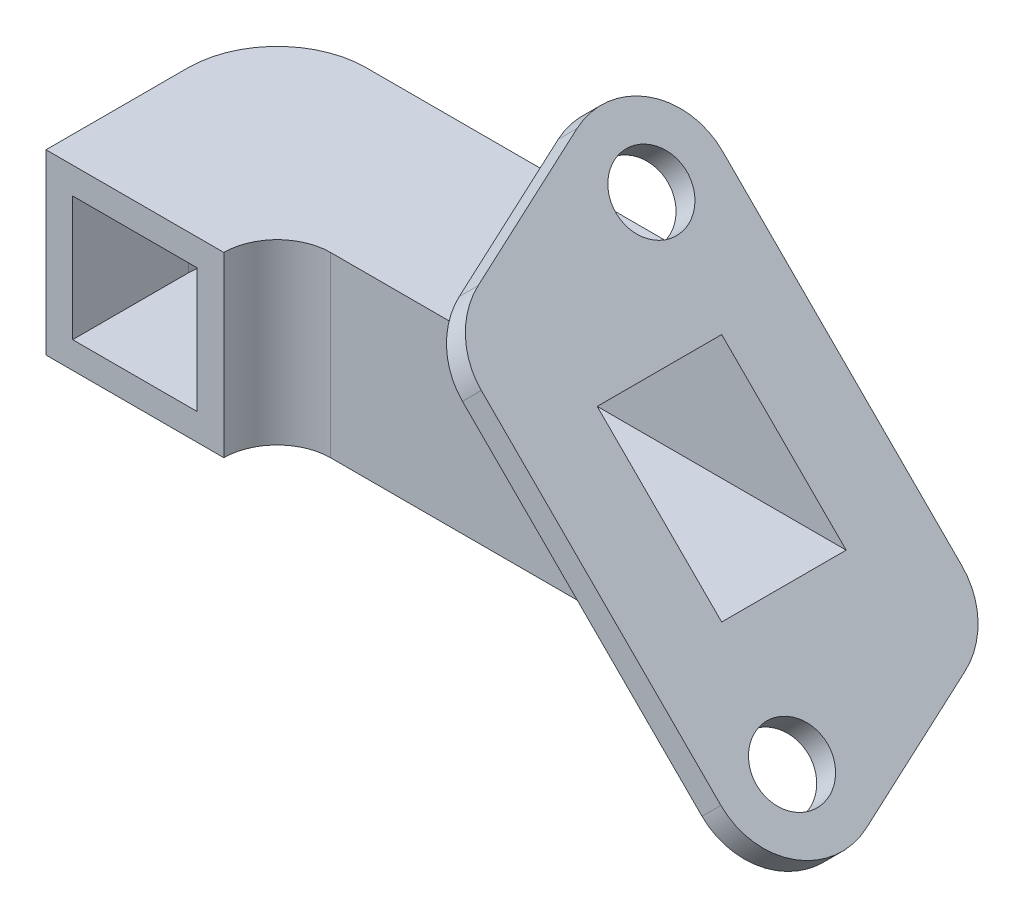
ISO-10303-21;
HEADER;
FILE_DESCRIPTION(('STEP AP214'),'2;1');
FILE_NAME('part.step','',(''),(''),'','','');
FILE_SCHEMA(('AUTOMOTIVE_DESIGN { 1 0 10303 214 1 1 1 1 }'));
ENDSEC;
DATA;
#1=APPLICATION_CONTEXT('core data for automotive mechanical design processes');
#2=APPLICATION_PROTOCOL_DEFINITION('international standard','automotive_design',2000,#1);
#3=PRODUCT_CONTEXT('',#1,'mechanical');
#4=PRODUCT('Part','Part','',(#3));
#5=PRODUCT_RELATED_PRODUCT_CATEGORY('part','',(#4));
#6=PRODUCT_DEFINITION_FORMATION('','',#4);
#7=PRODUCT_DEFINITION_CONTEXT('part definition',#1,'design');
#8=PRODUCT_DEFINITION('design','',#6,#7);
#9=PRODUCT_DEFINITION_SHAPE('','',#8);
#10=(LENGTH_UNIT() NAMED_UNIT(*) SI_UNIT(.MILLI.,.METRE.));
#11=(NAMED_UNIT(*) PLANE_ANGLE_UNIT() SI_UNIT($,.RADIAN.));
#12=(NAMED_UNIT(*) SI_UNIT($,.STERADIAN.) SOLID_ANGLE_UNIT());
#13=UNCERTAINTY_MEASURE_WITH_UNIT(LENGTH_MEASURE(1.E-05),#10,'distance_accuracy_value','');
#14=(GEOMETRIC_REPRESENTATION_CONTEXT(3) GLOBAL_UNCERTAINTY_ASSIGNED_CONTEXT((#13)) GLOBAL_UNIT_ASSIGNED_CONTEXT((#10,
#11,#12)) REPRESENTATION_CONTEXT('',''));
#15=CARTESIAN_POINT('',(0.,0.,0.));
#16=DIRECTION('',(0.,0.,1.));
#17=DIRECTION('',(1.,0.,0.));
#18=AXIS2_PLACEMENT_3D('',#15,#16,#17);
#19=CARTESIAN_POINT('',(22.071125761932,-22.0711257619321,-16.));
#20=DIRECTION('',(0.707106781186549,0.707106781186546,0.));
#21=DIRECTION('',(-0.707106781186546,0.707106781186549,0.));
#22=AXIS2_PLACEMENT_3D('',#19,#20,#21);
#23=PLANE('',#22);
#24=CARTESIAN_POINT('',(31.8198051533946,-31.8198051533947,16.));
#25=DIRECTION('',(0.707106781186549,0.707106781186546,0.));
#26=DIRECTION('',(-0.707106781186546,0.707106781186549,0.));
#27=AXIS2_PLACEMENT_3D('',#24,#25,#26);
#28=CIRCLE('',#27,8.);
#29=CARTESIAN_POINT('',(26.1629509039022,-26.1629509039023,16.));
#30=VERTEX_POINT('',#29);
#31=EDGE_CURVE('E260',#30,#30,#28,.T.);
#32=ORIENTED_EDGE('',*,*,#31,.F.);
#33=EDGE_LOOP('',(#32));
#34=FACE_BOUND('',#33,.T.);
#35=CARTESIAN_POINT('',(-31.8198051533946,31.8198051533947,-16.));
#36=DIRECTION('',(0.707106781186549,0.707106781186546,0.));
#37=DIRECTION('',(-0.707106781186546,0.707106781186549,0.));
#38=AXIS2_PLACEMENT_3D('',#35,#36,#37);
#39=CIRCLE('',#38,8.);
#40=CARTESIAN_POINT('',(-37.476659402887,37.4766594028871,-16.));
#41=VERTEX_POINT('',#40);
#42=EDGE_CURVE('E272',#41,#41,#39,.T.);
#43=ORIENTED_EDGE('',*,*,#42,.F.);
#44=EDGE_LOOP('',(#43));
#45=FACE_BOUND('',#44,.T.);
#46=CARTESIAN_POINT('',(22.071125761932,-22.0711257619321,-16.));
#47=DIRECTION('',(0.707106781186549,0.707106781186546,0.));
#48=DIRECTION('',(-0.707106781186546,0.707106781186549,0.));
#49=AXIS2_PLACEMENT_3D('',#46,#47,#48);
#50=CIRCLE('',#49,16.);
#51=CARTESIAN_POINT('',(32.4615306995758,-32.4615306995759,-22.3307954052849));
#52=VERTEX_POINT('',#51);
#53=CARTESIAN_POINT('',(22.071125761932,-22.0711257619321,-32.));
#54=VERTEX_POINT('',#53);
#55=EDGE_CURVE('E277',#52,#54,#50,.T.);
#56=ORIENTED_EDGE('',*,*,#55,.T.);
#57=DIRECTION('',(-0.707106781186546,0.707106781186549,0.));
#58=VECTOR('',#57,1.);
#59=CARTESIAN_POINT('',(-31.8198051533946,31.8198051533947,-32.));
#60=LINE('',#59,#58);
#61=CARTESIAN_POINT('',(-31.8198051533946,31.8198051533947,-32.));
#62=VERTEX_POINT('',#61);
#63=EDGE_CURVE('E308',#54,#62,#60,.T.);
#64=ORIENTED_EDGE('',*,*,#63,.T.);
#65=CARTESIAN_POINT('',(-31.8198051533946,31.8198051533947,-16.));
#66=DIRECTION('',(0.707106781186549,0.707106781186546,0.));
#67=DIRECTION('',(0.707106781186546,-0.707106781186549,0.));
#68=AXIS2_PLACEMENT_3D('',#65,#66,#67);
#69=CIRCLE('',#68,16.);
#70=CARTESIAN_POINT('',(-42.2102100910383,42.2102100910385,-9.66920459471507));
#71=VERTEX_POINT('',#70);
#72=EDGE_CURVE('E311',#62,#71,#69,.T.);
#73=ORIENTED_EDGE('',*,*,#72,.T.);
#74=DIRECTION('',(0.27978427258635,-0.279784272586351,0.918390723835261));
#75=VECTOR('',#74,1.);
#76=CARTESIAN_POINT('',(-32.4615306995758,32.4615306995759,22.3307954052849));
#77=LINE('',#76,#75);
#78=CARTESIAN_POINT('',(-32.4615306995758,32.4615306995759,22.3307954052849));
#79=VERTEX_POINT('',#78);
#80=EDGE_CURVE('E314',#71,#79,#77,.T.);
#81=ORIENTED_EDGE('',*,*,#80,.T.);
#82=CARTESIAN_POINT('',(-22.071125761932,22.0711257619321,16.));
#83=DIRECTION('',(0.707106781186549,0.707106781186546,0.));
#84=DIRECTION('',(0.707106781186546,-0.707106781186549,0.));
#85=AXIS2_PLACEMENT_3D('',#82,#83,#84);
#86=CIRCLE('',#85,16.);
#87=CARTESIAN_POINT('',(-22.071125761932,22.0711257619321,32.));
#88=VERTEX_POINT('',#87);
#89=EDGE_CURVE('E317',#79,#88,#86,.T.);
#90=ORIENTED_EDGE('',*,*,#89,.T.);
#91=DIRECTION('',(0.707106781186546,-0.707106781186549,0.));
#92=VECTOR('',#91,1.);
#93=CARTESIAN_POINT('',(31.8198051533946,-31.8198051533947,32.));
#94=LINE('',#93,#92);
#95=CARTESIAN_POINT('',(31.8198051533946,-31.8198051533947,32.));
#96=VERTEX_POINT('',#95);
#97=EDGE_CURVE('E320',#88,#96,#94,.T.);
#98=ORIENTED_EDGE('',*,*,#97,.T.);
#99=CARTESIAN_POINT('',(31.8198051533946,-31.8198051533947,16.));
#100=DIRECTION('',(0.707106781186549,0.707106781186546,0.));
#101=DIRECTION('',(0.707106781186546,-0.707106781186549,0.));
#102=AXIS2_PLACEMENT_3D('',#99,#100,#101);
#103=CIRCLE('',#102,16.);
#104=CARTESIAN_POINT('',(42.2102100910383,-42.2102100910385,9.66920459471509));
#105=VERTEX_POINT('',#104);
#106=EDGE_CURVE('E323',#96,#105,#103,.T.);
#107=ORIENTED_EDGE('',*,*,#106,.T.);
#108=DIRECTION('',(-0.279784272586349,0.27978427258635,-0.918390723835261));
#109=VECTOR('',#108,1.);
#110=CARTESIAN_POINT('',(32.4615306995758,-32.4615306995759,-22.3307954052849));
#111=LINE('',#110,#109);
#112=EDGE_CURVE('E284',#105,#52,#111,.T.);
#113=ORIENTED_EDGE('',*,*,#112,.T.);
#114=EDGE_LOOP('',(#56,#64,#73,#81,#90,#98,#107,#113));
#115=FACE_BOUND('',#114,.T.);
#116=DIRECTION('',(-0.707106781186546,0.707106781186549,0.));
#117=VECTOR('',#116,1.);
#118=CARTESIAN_POINT('',(22.071125761932,-22.0711257619321,-14.));
#119=LINE('',#118,#117);
#120=CARTESIAN_POINT('',(14.,-14.,-14.));
#121=VERTEX_POINT('',#120);
#122=CARTESIAN_POINT('',(-14.,14.,-14.));
#123=VERTEX_POINT('',#122);
#124=EDGE_CURVE('E218',#121,#123,#119,.T.);
#125=ORIENTED_EDGE('',*,*,#124,.F.);
#126=DIRECTION('',(0.,0.,1.));
#127=VECTOR('',#126,1.);
#128=CARTESIAN_POINT('',(14.,-14.,-16.));
#129=LINE('',#128,#127);
#130=CARTESIAN_POINT('',(14.,-14.,14.));
#131=VERTEX_POINT('',#130);
#132=EDGE_CURVE('E449',#121,#131,#129,.T.);
#133=ORIENTED_EDGE('',*,*,#132,.T.);
#134=DIRECTION('',(0.707106781186546,-0.707106781186549,0.));
#135=VECTOR('',#134,1.);
#136=CARTESIAN_POINT('',(22.071125761932,-22.0711257619321,14.));
#137=LINE('',#136,#135);
#138=CARTESIAN_POINT('',(-14.,14.,14.));
#139=VERTEX_POINT('',#138);
#140=EDGE_CURVE('E212',#139,#131,#137,.T.);
#141=ORIENTED_EDGE('',*,*,#140,.F.);
#142=DIRECTION('',(0.,0.,1.));
#143=VECTOR('',#142,1.);
#144=CARTESIAN_POINT('',(-14.,14.,-16.));
#145=LINE('',#144,#143);
#146=EDGE_CURVE('E451',#123,#139,#145,.T.);
#147=ORIENTED_EDGE('',*,*,#146,.F.);
#148=EDGE_LOOP('',(#125,#133,#141,#147));
#149=FACE_BOUND('',#148,.T.);
#150=ADVANCED_FACE('F33',(#34,#45,#115,#149),#23,.T.);
#151=CARTESIAN_POINT('',(0.,0.,32.));
#152=DIRECTION('',(0.,0.,1.));
#153=DIRECTION('',(1.,0.,0.));
#154=AXIS2_PLACEMENT_3D('',#151,#152,#153);
#155=PLANE('',#154);
#156=DIRECTION('',(0.,-1.,0.));
#157=VECTOR('',#156,1.);
#158=CARTESIAN_POINT('',(-120.,20.,32.));
#159=LINE('',#158,#157);
#160=CARTESIAN_POINT('',(-120.,20.,32.));
#161=VERTEX_POINT('',#160);
#162=CARTESIAN_POINT('',(-120.,-20.,32.));
#163=VERTEX_POINT('',#162);
#164=EDGE_CURVE('E471',#161,#163,#159,.T.);
#165=ORIENTED_EDGE('',*,*,#164,.T.);
#166=DIRECTION('',(1.,0.,0.));
#167=VECTOR('',#166,1.);
#168=CARTESIAN_POINT('',(-120.,-20.,32.));
#169=LINE('',#168,#167);
#170=CARTESIAN_POINT('',(-80.,-20.,32.));
#171=VERTEX_POINT('',#170);
#172=EDGE_CURVE('E258',#163,#171,#169,.T.);
#173=ORIENTED_EDGE('',*,*,#172,.T.);
#174=DIRECTION('',(0.,1.,0.));
#175=VECTOR('',#174,1.);
#176=CARTESIAN_POINT('',(-80.,20.,32.));
#177=LINE('',#176,#175);
#178=CARTESIAN_POINT('',(-80.,20.,32.));
#179=VERTEX_POINT('',#178);
#180=EDGE_CURVE('E474',#171,#179,#177,.T.);
#181=ORIENTED_EDGE('',*,*,#180,.T.);
#182=DIRECTION('',(-1.,0.,0.));
#183=VECTOR('',#182,1.);
#184=CARTESIAN_POINT('',(-120.,20.,32.));
#185=LINE('',#184,#183);
#186=EDGE_CURVE('E477',#179,#161,#185,.T.);
#187=ORIENTED_EDGE('',*,*,#186,.T.);
#188=EDGE_LOOP('',(#165,#173,#181,#187));
#189=FACE_BOUND('',#188,.T.);
#190=DIRECTION('',(0.,1.,0.));
#191=VECTOR('',#190,1.);
#192=CARTESIAN_POINT('',(-86.,0.,32.));
#193=LINE('',#192,#191);
#194=CARTESIAN_POINT('',(-86.,-14.,32.));
#195=VERTEX_POINT('',#194);
#196=CARTESIAN_POINT('',(-86.,14.,32.));
#197=VERTEX_POINT('',#196);
#198=EDGE_CURVE('E206',#195,#197,#193,.T.);
#199=ORIENTED_EDGE('',*,*,#198,.F.);
#200=DIRECTION('',(-1.,0.,0.));
#201=VECTOR('',#200,1.);
#202=CARTESIAN_POINT('',(0.,-14.,32.));
#203=LINE('',#202,#201);
#204=CARTESIAN_POINT('',(-114.,-14.,32.));
#205=VERTEX_POINT('',#204);
#206=EDGE_CURVE('E210',#195,#205,#203,.T.);
#207=ORIENTED_EDGE('',*,*,#206,.T.);
#208=DIRECTION('',(0.,-1.,0.));
#209=VECTOR('',#208,1.);
#210=CARTESIAN_POINT('',(-114.,0.,32.));
#211=LINE('',#210,#209);
#212=CARTESIAN_POINT('',(-114.,14.,32.));
#213=VERTEX_POINT('',#212);
#214=EDGE_CURVE('E192',#213,#205,#211,.T.);
#215=ORIENTED_EDGE('',*,*,#214,.F.);
#216=DIRECTION('',(-1.,0.,0.));
#217=VECTOR('',#216,1.);
#218=CARTESIAN_POINT('',(0.,14.,32.));
#219=LINE('',#218,#217);
#220=EDGE_CURVE('E200',#197,#213,#219,.T.);
#221=ORIENTED_EDGE('',*,*,#220,.F.);
#222=EDGE_LOOP('',(#199,#207,#215,#221));
#223=FACE_BOUND('',#222,.T.);
#224=ADVANCED_FACE('F209',(#189,#223),#155,.T.);
#225=CARTESIAN_POINT('',(0.,0.,20.));
#226=DIRECTION('',(0.,0.,1.));
#227=DIRECTION('',(1.,0.,0.));
#228=AXIS2_PLACEMENT_3D('',#225,#226,#227);
#229=PLANE('',#228);
#230=DIRECTION('',(1.,0.,0.));
#231=VECTOR('',#230,1.);
#232=CARTESIAN_POINT('',(-120.,20.,20.));
#233=LINE('',#232,#231);
#234=CARTESIAN_POINT('',(-68.,20.,20.));
#235=VERTEX_POINT('',#234);
#236=CARTESIAN_POINT('',(-28.4852813742385,20.,20.));
#237=VERTEX_POINT('',#236);
#238=EDGE_CURVE('E487',#235,#237,#233,.T.);
#239=ORIENTED_EDGE('',*,*,#238,.F.);
#240=DIRECTION('',(0.,1.,0.));
#241=VECTOR('',#240,1.);
#242=CARTESIAN_POINT('',(-68.,0.,20.));
#243=LINE('',#242,#241);
#244=CARTESIAN_POINT('',(-68.,-20.,20.));
#245=VERTEX_POINT('',#244);
#246=EDGE_CURVE('E221',#235,#245,#243,.F.);
#247=ORIENTED_EDGE('',*,*,#246,.T.);
#248=DIRECTION('',(1.,0.,0.));
#249=VECTOR('',#248,1.);
#250=CARTESIAN_POINT('',(-120.,-20.,20.));
#251=LINE('',#250,#249);
#252=CARTESIAN_POINT('',(11.5147186257614,-20.,20.));
#253=VERTEX_POINT('',#252);
#254=EDGE_CURVE('E481',#245,#253,#251,.T.);
#255=ORIENTED_EDGE('',*,*,#254,.T.);
#256=DIRECTION('',(0.707106781186546,-0.707106781186549,0.));
#257=VECTOR('',#256,1.);
#258=CARTESIAN_POINT('',(-28.4852813742385,20.,20.));
#259=LINE('',#258,#257);
#260=EDGE_CURVE('E483',#237,#253,#259,.T.);
#261=ORIENTED_EDGE('',*,*,#260,.F.);
#262=EDGE_LOOP('',(#239,#247,#255,#261));
#263=FACE_BOUND('',#262,.T.);
#264=ADVANCED_FACE('F391',(#263),#229,.T.);
#265=CARTESIAN_POINT('',(17.8284850748127,-26.3137664490514,-16.));
#266=DIRECTION('',(0.707106781186549,0.707106781186546,0.));
#267=DIRECTION('',(-0.707106781186546,0.707106781186549,0.));
#268=AXIS2_PLACEMENT_3D('',#265,#266,#267);
#269=CYLINDRICAL_SURFACE('',#268,16.);
#270=ORIENTED_EDGE('',*,*,#55,.F.);
#271=DIRECTION('',(0.707106781186549,0.707106781186546,0.));
#272=VECTOR('',#271,1.);
#273=CARTESIAN_POINT('',(28.2188900124565,-36.7041713866952,-22.3307954052849));
#274=LINE('',#273,#272);
#275=CARTESIAN_POINT('',(28.2188900124565,-36.7041713866952,-22.3307954052849));
#276=VERTEX_POINT('',#275);
#277=EDGE_CURVE('E207',#276,#52,#274,.T.);
#278=ORIENTED_EDGE('',*,*,#277,.F.);
#279=CARTESIAN_POINT('',(17.8284850748127,-26.3137664490514,-16.));
#280=DIRECTION('',(0.707106781186549,0.707106781186546,0.));
#281=DIRECTION('',(-0.707106781186546,0.707106781186549,0.));
#282=AXIS2_PLACEMENT_3D('',#279,#280,#281);
#283=CIRCLE('',#282,16.);
#284=CARTESIAN_POINT('',(17.8284850748127,-26.3137664490514,-32.));
#285=VERTEX_POINT('',#284);
#286=EDGE_CURVE('E280',#276,#285,#283,.T.);
#287=ORIENTED_EDGE('',*,*,#286,.T.);
#288=DIRECTION('',(0.707106781186549,0.707106781186546,0.));
#289=VECTOR('',#288,1.);
#290=CARTESIAN_POINT('',(17.8284850748127,-26.3137664490514,-32.));
#291=LINE('',#290,#289);
#292=EDGE_CURVE('E305',#285,#54,#291,.T.);
#293=ORIENTED_EDGE('',*,*,#292,.T.);
#294=EDGE_LOOP('',(#270,#278,#287,#293));
#295=FACE_BOUND('',#294,.T.);
#296=ADVANCED_FACE('F344',(#295),#269,.T.);
#297=CARTESIAN_POINT('',(28.2188900124565,-36.7041713866952,-22.3307954052849));
#298=DIRECTION('',(0.649400308602734,-0.649400308602736,-0.395674712830307));
#299=DIRECTION('',(0.707106781186549,0.707106781186546,0.));
#300=AXIS2_PLACEMENT_3D('',#297,#298,#299);
#301=PLANE('',#300);
#302=ORIENTED_EDGE('',*,*,#112,.F.);
#303=DIRECTION('',(0.707106781186549,0.707106781186546,0.));
#304=VECTOR('',#303,1.);
#305=CARTESIAN_POINT('',(37.967569403919,-46.4528507781577,9.66920459471509));
#306=LINE('',#305,#304);
#307=CARTESIAN_POINT('',(37.967569403919,-46.4528507781577,9.66920459471509));
#308=VERTEX_POINT('',#307);
#309=EDGE_CURVE('E329',#308,#105,#306,.T.);
#310=ORIENTED_EDGE('',*,*,#309,.F.);
#311=DIRECTION('',(-0.279784272586349,0.27978427258635,-0.918390723835261));
#312=VECTOR('',#311,1.);
#313=CARTESIAN_POINT('',(28.2188900124565,-36.7041713866952,-22.3307954052849));
#314=LINE('',#313,#312);
#315=EDGE_CURVE('E302',#308,#276,#314,.T.);
#316=ORIENTED_EDGE('',*,*,#315,.T.);
#317=ORIENTED_EDGE('',*,*,#277,.T.);
#318=EDGE_LOOP('',(#302,#310,#316,#317));
#319=FACE_BOUND('',#318,.T.);
#320=ADVANCED_FACE('F355',(#319),#301,.T.);
#321=CARTESIAN_POINT('',(27.5771644662753,-36.062445840514,16.));
#322=DIRECTION('',(0.707106781186549,0.707106781186546,0.));
#323=DIRECTION('',(-0.707106781186546,0.707106781186549,0.));
#324=AXIS2_PLACEMENT_3D('',#321,#322,#323);
#325=CYLINDRICAL_SURFACE('',#324,16.);
#326=ORIENTED_EDGE('',*,*,#106,.F.);
#327=DIRECTION('',(0.707106781186549,0.707106781186546,0.));
#328=VECTOR('',#327,1.);
#329=CARTESIAN_POINT('',(27.5771644662753,-36.062445840514,32.));
#330=LINE('',#329,#328);
#331=CARTESIAN_POINT('',(27.5771644662753,-36.062445840514,32.));
#332=VERTEX_POINT('',#331);
#333=EDGE_CURVE('E331',#332,#96,#330,.T.);
#334=ORIENTED_EDGE('',*,*,#333,.F.);
#335=CARTESIAN_POINT('',(27.5771644662753,-36.062445840514,16.));
#336=DIRECTION('',(0.707106781186549,0.707106781186546,0.));
#337=DIRECTION('',(0.707106781186546,-0.707106781186549,0.));
#338=AXIS2_PLACEMENT_3D('',#335,#336,#337);
#339=CIRCLE('',#338,16.);
#340=EDGE_CURVE('E299',#332,#308,#339,.T.);
#341=ORIENTED_EDGE('',*,*,#340,.T.);
#342=ORIENTED_EDGE('',*,*,#309,.T.);
#343=EDGE_LOOP('',(#326,#334,#341,#342));
#344=FACE_BOUND('',#343,.T.);
#345=ADVANCED_FACE('F376',(#344),#325,.T.);
#346=CARTESIAN_POINT('',(27.5771644662753,-36.062445840514,32.));
#347=DIRECTION('',(0.,0.,1.));
#348=DIRECTION('',(1.,0.,0.));
#349=AXIS2_PLACEMENT_3D('',#346,#347,#348);
#350=PLANE('',#349);
#351=ORIENTED_EDGE('',*,*,#97,.F.);
#352=DIRECTION('',(0.707106781186549,0.707106781186546,0.));
#353=VECTOR('',#352,1.);
#354=CARTESIAN_POINT('',(-26.3137664490513,17.8284850748128,32.));
#355=LINE('',#354,#353);
#356=CARTESIAN_POINT('',(-26.3137664490513,17.8284850748128,32.));
#357=VERTEX_POINT('',#356);
#358=EDGE_CURVE('E333',#357,#88,#355,.T.);
#359=ORIENTED_EDGE('',*,*,#358,.F.);
#360=DIRECTION('',(0.707106781186546,-0.707106781186549,0.));
#361=VECTOR('',#360,1.);
#362=CARTESIAN_POINT('',(27.5771644662753,-36.062445840514,32.));
#363=LINE('',#362,#361);
#364=EDGE_CURVE('E296',#357,#332,#363,.T.);
#365=ORIENTED_EDGE('',*,*,#364,.T.);
#366=ORIENTED_EDGE('',*,*,#333,.T.);
#367=EDGE_LOOP('',(#351,#359,#365,#366));
#368=FACE_BOUND('',#367,.T.);
#369=ADVANCED_FACE('F374',(#368),#350,.T.);
#370=CARTESIAN_POINT('',(-26.3137664490513,17.8284850748128,16.));
#371=DIRECTION('',(0.707106781186549,0.707106781186546,0.));
#372=DIRECTION('',(-0.707106781186546,0.707106781186549,0.));
#373=AXIS2_PLACEMENT_3D('',#370,#371,#372);
#374=CYLINDRICAL_SURFACE('',#373,16.);
#375=ORIENTED_EDGE('',*,*,#89,.F.);
#376=DIRECTION('',(0.707106781186549,0.707106781186546,0.));
#377=VECTOR('',#376,1.);
#378=CARTESIAN_POINT('',(-36.704171386695,28.2188900124566,22.3307954052849));
#379=LINE('',#378,#377);
#380=CARTESIAN_POINT('',(-36.704171386695,28.2188900124566,22.3307954052849));
#381=VERTEX_POINT('',#380);
#382=EDGE_CURVE('E335',#381,#79,#379,.T.);
#383=ORIENTED_EDGE('',*,*,#382,.F.);
#384=CARTESIAN_POINT('',(-26.3137664490513,17.8284850748128,16.));
#385=DIRECTION('',(0.707106781186549,0.707106781186546,0.));
#386=DIRECTION('',(0.707106781186546,-0.707106781186549,0.));
#387=AXIS2_PLACEMENT_3D('',#384,#385,#386);
#388=CIRCLE('',#387,16.);
#389=EDGE_CURVE('E293',#381,#357,#388,.T.);
#390=ORIENTED_EDGE('',*,*,#389,.T.);
#391=ORIENTED_EDGE('',*,*,#358,.T.);
#392=EDGE_LOOP('',(#375,#383,#390,#391));
#393=FACE_BOUND('',#392,.T.);
#394=ADVANCED_FACE('F370',(#393),#374,.T.);
#395=CARTESIAN_POINT('',(-36.704171386695,28.2188900124566,22.3307954052849));
#396=DIRECTION('',(-0.649400308602733,0.649400308602736,0.395674712830307));
#397=DIRECTION('',(-0.707106781186549,-0.707106781186546,0.));
#398=AXIS2_PLACEMENT_3D('',#395,#396,#397);
#399=PLANE('',#398);
#400=ORIENTED_EDGE('',*,*,#80,.F.);
#401=DIRECTION('',(0.707106781186549,0.707106781186546,0.));
#402=VECTOR('',#401,1.);
#403=CARTESIAN_POINT('',(-46.4528507781576,37.9675694039192,-9.66920459471507));
#404=LINE('',#403,#402);
#405=CARTESIAN_POINT('',(-46.4528507781576,37.9675694039192,-9.66920459471507));
#406=VERTEX_POINT('',#405);
#407=EDGE_CURVE('E337',#406,#71,#404,.T.);
#408=ORIENTED_EDGE('',*,*,#407,.F.);
#409=DIRECTION('',(0.27978427258635,-0.279784272586351,0.918390723835261));
#410=VECTOR('',#409,1.);
#411=CARTESIAN_POINT('',(-36.704171386695,28.2188900124566,22.3307954052849));
#412=LINE('',#411,#410);
#413=EDGE_CURVE('E290',#406,#381,#412,.T.);
#414=ORIENTED_EDGE('',*,*,#413,.T.);
#415=ORIENTED_EDGE('',*,*,#382,.T.);
#416=EDGE_LOOP('',(#400,#408,#414,#415));
#417=FACE_BOUND('',#416,.T.);
#418=ADVANCED_FACE('F368',(#417),#399,.T.);
#419=CARTESIAN_POINT('',(-36.0624458405139,27.5771644662754,-16.));
#420=DIRECTION('',(0.707106781186549,0.707106781186546,0.));
#421=DIRECTION('',(-0.707106781186546,0.707106781186549,0.));
#422=AXIS2_PLACEMENT_3D('',#419,#420,#421);
#423=CYLINDRICAL_SURFACE('',#422,16.);
#424=ORIENTED_EDGE('',*,*,#72,.F.);
#425=DIRECTION('',(0.707106781186549,0.707106781186546,0.));
#426=VECTOR('',#425,1.);
#427=CARTESIAN_POINT('',(-36.0624458405139,27.5771644662754,-32.));
#428=LINE('',#427,#426);
#429=CARTESIAN_POINT('',(-36.0624458405139,27.5771644662754,-32.));
#430=VERTEX_POINT('',#429);
#431=EDGE_CURVE('E339',#430,#62,#428,.T.);
#432=ORIENTED_EDGE('',*,*,#431,.F.);
#433=CARTESIAN_POINT('',(-36.0624458405139,27.5771644662754,-16.));
#434=DIRECTION('',(0.707106781186549,0.707106781186546,0.));
#435=DIRECTION('',(0.707106781186546,-0.707106781186549,0.));
#436=AXIS2_PLACEMENT_3D('',#433,#434,#435);
#437=CIRCLE('',#436,16.);
#438=EDGE_CURVE('E287',#430,#406,#437,.T.);
#439=ORIENTED_EDGE('',*,*,#438,.T.);
#440=ORIENTED_EDGE('',*,*,#407,.T.);
#441=EDGE_LOOP('',(#424,#432,#439,#440));
#442=FACE_BOUND('',#441,.T.);
#443=ADVANCED_FACE('F364',(#442),#423,.T.);
#444=CARTESIAN_POINT('',(-36.0624458405139,27.5771644662754,-32.));
#445=DIRECTION('',(0.,0.,-1.));
#446=DIRECTION('',(0.,1.,0.));
#447=AXIS2_PLACEMENT_3D('',#444,#445,#446);
#448=PLANE('',#447);
#449=ORIENTED_EDGE('',*,*,#63,.F.);
#450=ORIENTED_EDGE('',*,*,#292,.F.);
#451=DIRECTION('',(-0.707106781186546,0.707106781186549,0.));
#452=VECTOR('',#451,1.);
#453=CARTESIAN_POINT('',(-36.0624458405139,27.5771644662754,-32.));
#454=LINE('',#453,#452);
#455=EDGE_CURVE('E283',#285,#430,#454,.T.);
#456=ORIENTED_EDGE('',*,*,#455,.T.);
#457=ORIENTED_EDGE('',*,*,#431,.T.);
#458=EDGE_LOOP('',(#449,#450,#456,#457));
#459=FACE_BOUND('',#458,.T.);
#460=ADVANCED_FACE('F348',(#459),#448,.T.);
#461=CARTESIAN_POINT('',(17.8284850748127,-26.3137664490514,-16.));
#462=DIRECTION('',(0.707106781186549,0.707106781186546,0.));
#463=DIRECTION('',(-0.707106781186546,0.707106781186549,0.));
#464=AXIS2_PLACEMENT_3D('',#461,#462,#463);
#465=PLANE('',#464);
#466=DIRECTION('',(0.,0.,-1.));
#467=VECTOR('',#466,1.);
#468=CARTESIAN_POINT('',(-28.4852813742385,20.,20.));
#469=LINE('',#468,#467);
#470=CARTESIAN_POINT('',(-28.4852813742385,20.,-20.));
#471=VERTEX_POINT('',#470);
#472=EDGE_CURVE('E267',#237,#471,#469,.T.);
#473=ORIENTED_EDGE('',*,*,#472,.F.);
#474=ORIENTED_EDGE('',*,*,#260,.T.);
#475=DIRECTION('',(0.,0.,-1.));
#476=VECTOR('',#475,1.);
#477=CARTESIAN_POINT('',(11.5147186257614,-20.,20.));
#478=LINE('',#477,#476);
#479=CARTESIAN_POINT('',(11.5147186257614,-20.,-20.));
#480=VERTEX_POINT('',#479);
#481=EDGE_CURVE('E261',#253,#480,#478,.T.);
#482=ORIENTED_EDGE('',*,*,#481,.T.);
#483=DIRECTION('',(0.707106781186546,-0.707106781186549,0.));
#484=VECTOR('',#483,1.);
#485=CARTESIAN_POINT('',(-28.4852813742385,20.,-20.));
#486=LINE('',#485,#484);
#487=EDGE_CURVE('E490',#471,#480,#486,.T.);
#488=ORIENTED_EDGE('',*,*,#487,.F.);
#489=EDGE_LOOP('',(#473,#474,#482,#488));
#490=FACE_BOUND('',#489,.T.);
#491=CARTESIAN_POINT('',(27.5771644662753,-36.062445840514,16.));
#492=DIRECTION('',(0.707106781186549,0.707106781186546,0.));
#493=DIRECTION('',(-0.707106781186546,0.707106781186549,0.));
#494=AXIS2_PLACEMENT_3D('',#491,#492,#493);
#495=CIRCLE('',#494,8.);
#496=CARTESIAN_POINT('',(21.9203102167829,-30.4055915910216,16.));
#497=VERTEX_POINT('',#496);
#498=EDGE_CURVE('E264',#497,#497,#495,.T.);
#499=ORIENTED_EDGE('',*,*,#498,.T.);
#500=EDGE_LOOP('',(#499));
#501=FACE_BOUND('',#500,.T.);
#502=CARTESIAN_POINT('',(-36.0624458405139,27.5771644662754,-16.));
#503=DIRECTION('',(0.707106781186549,0.707106781186546,0.));
#504=DIRECTION('',(-0.707106781186546,0.707106781186549,0.));
#505=AXIS2_PLACEMENT_3D('',#502,#503,#504);
#506=CIRCLE('',#505,8.);
#507=CARTESIAN_POINT('',(-41.7193000900063,33.2340187157678,-16.));
#508=VERTEX_POINT('',#507);
#509=EDGE_CURVE('E274',#508,#508,#506,.T.);
#510=ORIENTED_EDGE('',*,*,#509,.T.);
#511=EDGE_LOOP('',(#510));
#512=FACE_BOUND('',#511,.T.);
#513=ORIENTED_EDGE('',*,*,#286,.F.);
#514=ORIENTED_EDGE('',*,*,#315,.F.);
#515=ORIENTED_EDGE('',*,*,#340,.F.);
#516=ORIENTED_EDGE('',*,*,#364,.F.);
#517=ORIENTED_EDGE('',*,*,#389,.F.);
#518=ORIENTED_EDGE('',*,*,#413,.F.);
#519=ORIENTED_EDGE('',*,*,#438,.F.);
#520=ORIENTED_EDGE('',*,*,#455,.F.);
#521=EDGE_LOOP('',(#513,#514,#515,#516,#517,#518,#519,#520));
#522=FACE_BOUND('',#521,.T.);
#523=ADVANCED_FACE('F358',(#490,#501,#512,#522),#465,.F.);
#524=CARTESIAN_POINT('',(-36.0624458405139,27.5771644662754,-16.));
#525=DIRECTION('',(0.707106781186549,0.707106781186546,0.));
#526=DIRECTION('',(-0.707106781186546,0.707106781186549,0.));
#527=AXIS2_PLACEMENT_3D('',#524,#525,#526);
#528=CYLINDRICAL_SURFACE('',#527,8.);
#529=CARTESIAN_POINT('',(-41.7193000900063,33.2340187157678,-16.));
#530=CARTESIAN_POINT('',(-41.6751059161821,33.278212889592,-16.));
#531=CARTESIAN_POINT('',(-41.6309117423579,33.3224070634161,-16.));
#532=CARTESIAN_POINT('',(-41.5425233947096,33.4107954110644,-16.));
#533=CARTESIAN_POINT('',(-41.4983292208855,33.4549895848886,-16.));
#534=CARTESIAN_POINT('',(-41.4099408732371,33.5433779325369,-16.));
#535=CARTESIAN_POINT('',(-41.365746699413,33.5875721063611,-16.));
#536=CARTESIAN_POINT('',(-41.2773583517647,33.6759604540094,-16.));
#537=CARTESIAN_POINT('',(-41.2331641779405,33.7201546278336,-16.));
#538=CARTESIAN_POINT('',(-41.1447758302922,33.8085429754819,-16.));
#539=CARTESIAN_POINT('',(-41.100581656468,33.852737149306,-16.));
#540=CARTESIAN_POINT('',(-41.0121933088197,33.9411254969544,-16.));
#541=CARTESIAN_POINT('',(-40.9679991349955,33.9853196707785,-16.));
#542=CARTESIAN_POINT('',(-40.8796107873472,34.0737080184268,-16.));
#543=CARTESIAN_POINT('',(-40.8354166135231,34.117902192251,-16.));
#544=CARTESIAN_POINT('',(-40.7470282658747,34.2062905398993,-16.));
#545=CARTESIAN_POINT('',(-40.7028340920506,34.2504847137235,-16.));
#546=CARTESIAN_POINT('',(-40.6144457444023,34.3388730613718,-16.));
#547=CARTESIAN_POINT('',(-40.5702515705781,34.3830672351959,-16.));
#548=CARTESIAN_POINT('',(-40.4818632229298,34.4714555828443,-16.));
#549=CARTESIAN_POINT('',(-40.4376690491056,34.5156497566684,-16.));
#550=CARTESIAN_POINT('',(-40.3492807014573,34.6040381043167,-16.));
#551=CARTESIAN_POINT('',(-40.3050865276332,34.6482322781409,-16.));
#552=CARTESIAN_POINT('',(-40.2166981799848,34.7366206257892,-16.));
#553=CARTESIAN_POINT('',(-40.1725040061607,34.7808147996134,-16.));
#554=CARTESIAN_POINT('',(-40.0841156585124,34.8692031472617,-16.));
#555=CARTESIAN_POINT('',(-40.0399214846882,34.9133973210859,-16.));
#556=CARTESIAN_POINT('',(-39.9515331370399,35.0017856687342,-16.));
#557=CARTESIAN_POINT('',(-39.9073389632157,35.0459798425583,-16.));
#558=CARTESIAN_POINT('',(-39.8189506155674,35.1343681902067,-16.));
#559=CARTESIAN_POINT('',(-39.7747564417432,35.1785623640308,-16.));
#560=CARTESIAN_POINT('',(-39.6863680940949,35.2669507116791,-16.));
#561=CARTESIAN_POINT('',(-39.6421739202708,35.3111448855033,-16.));
#562=CARTESIAN_POINT('',(-39.5537855726224,35.3995332331516,-16.));
#563=CARTESIAN_POINT('',(-39.5095913987983,35.4437274069758,-16.));
#564=CARTESIAN_POINT('',(-39.42120305115,35.5321157546241,-16.));
#565=CARTESIAN_POINT('',(-39.3770088773258,35.5763099284482,-16.));
#566=CARTESIAN_POINT('',(-39.2886205296775,35.6646982760966,-16.));
#567=CARTESIAN_POINT('',(-39.2444263558533,35.7088924499207,-16.));
#568=CARTESIAN_POINT('',(-39.156038008205,35.797280797569,-16.));
#569=CARTESIAN_POINT('',(-39.1118438343808,35.8414749713932,-16.));
#570=CARTESIAN_POINT('',(-39.0234554867325,35.9298633190415,-16.));
#571=CARTESIAN_POINT('',(-38.9792613129084,35.9740574928657,-16.));
#572=CARTESIAN_POINT('',(-38.8908729652601,36.062445840514,-16.));
#573=CARTESIAN_POINT('',(-38.8466787914359,36.1066400143382,-16.));
#574=CARTESIAN_POINT('',(-38.7582904437876,36.1950283619865,-16.));
#575=CARTESIAN_POINT('',(-38.7140962699634,36.2392225358106,-16.));
#576=CARTESIAN_POINT('',(-38.6257079223151,36.3276108834589,-16.));
#577=CARTESIAN_POINT('',(-38.5815137484909,36.3718050572831,-16.));
#578=CARTESIAN_POINT('',(-38.4931254008426,36.4601934049314,-16.));
#579=CARTESIAN_POINT('',(-38.4489312270185,36.5043875787556,-16.));
#580=CARTESIAN_POINT('',(-38.3605428793701,36.5927759264039,-16.));
#581=CARTESIAN_POINT('',(-38.316348705546,36.6369701002281,-16.));
#582=CARTESIAN_POINT('',(-38.2279603578977,36.7253584478764,-16.));
#583=CARTESIAN_POINT('',(-38.1837661840735,36.7695526217005,-16.));
#584=CARTESIAN_POINT('',(-38.0953778364252,36.8579409693489,-16.));
#585=CARTESIAN_POINT('',(-38.051183662601,36.902135143173,-16.));
#586=CARTESIAN_POINT('',(-37.9627953149527,36.9905234908213,-16.));
#587=CARTESIAN_POINT('',(-37.9186011411285,37.0347176646455,-16.));
#588=CARTESIAN_POINT('',(-37.8302127934802,37.1231060122938,-16.));
#589=CARTESIAN_POINT('',(-37.7860186196561,37.167300186118,-16.));
#590=CARTESIAN_POINT('',(-37.6976302720077,37.2556885337663,-16.));
#591=CARTESIAN_POINT('',(-37.6534360981836,37.2998827075904,-16.));
#592=CARTESIAN_POINT('',(-37.5650477505353,37.3882710552388,-16.));
#593=CARTESIAN_POINT('',(-37.5208535767111,37.4324652290629,-16.));
#594=CARTESIAN_POINT('',(-37.476659402887,37.4766594028871,-16.));
#595=B_SPLINE_CURVE_WITH_KNOTS('',3,(#529,#530,#531,#532,#533,#534,#535,#536,#537,#538,#539,
#540,#541,#542,#543,#544,#545,#546,#547,#548,#549,#550,#551,#552,#553,#554,#555,#556,#557,#558,
#559,#560,#561,#562,#563,#564,#565,#566,#567,#568,#569,#570,#571,#572,#573,#574,#575,#576,#577,
#578,#579,#580,#581,#582,#583,#584,#585,#586,#587,#588,#589,#590,#591,#592,#593,#594),
.UNSPECIFIED.,.F.,.F.,(4,2,2,2,2,2,2,2,2,2,2,2,2,2,2,2,2,2,2,2,2,2,2,2,2,2,2,2,2,2,2,2,4),(0.,
0.187500000000007,0.375000000000004,0.562500000000005,0.750000000000007,0.937500000000004,
1.12500000000001,1.3125,1.5,1.68750000000001,1.875,2.0625,2.25000000000001,2.4375,
2.62500000000001,2.81250000000001,3.,3.18750000000001,3.37500000000001,3.5625,3.75000000000001,
3.9375,4.12500000000001,4.31250000000001,4.5,4.68750000000001,4.87500000000001,5.0625,5.25,
5.43750000000001,5.62500000000001,5.8125,6.00000000000001),.UNSPECIFIED.);
#596=EDGE_CURVE('BSEAM399',#508,#41,#595,.T.);
#597=ORIENTED_EDGE('',*,*,#509,.F.);
#598=ORIENTED_EDGE('',*,*,#42,.T.);
#599=ORIENTED_EDGE('',*,*,#596,.T.);
#600=ORIENTED_EDGE('',*,*,#596,.F.);
#601=EDGE_LOOP('',(#597,#599,#598,#600));
#602=FACE_BOUND('',#601,.T.);
#603=ADVANCED_FACE('F399',(#602),#528,.F.);
#604=CARTESIAN_POINT('',(27.5771644662753,-36.062445840514,16.));
#605=DIRECTION('',(0.707106781186549,0.707106781186546,0.));
#606=DIRECTION('',(-0.707106781186546,0.707106781186549,0.));
#607=AXIS2_PLACEMENT_3D('',#604,#605,#606);
#608=CYLINDRICAL_SURFACE('',#607,8.);
#609=CARTESIAN_POINT('',(21.9203102167829,-30.4055915910216,16.));
#610=CARTESIAN_POINT('',(21.9645043906071,-30.3613974171974,16.));
#611=CARTESIAN_POINT('',(22.0086985644312,-30.3172032433733,16.));
#612=CARTESIAN_POINT('',(22.0970869120796,-30.2288148957249,16.));
#613=CARTESIAN_POINT('',(22.1412810859037,-30.1846207219008,16.));
#614=CARTESIAN_POINT('',(22.229669433552,-30.0962323742525,16.));
#615=CARTESIAN_POINT('',(22.2738636073762,-30.0520382004283,16.));
#616=CARTESIAN_POINT('',(22.3622519550245,-29.96364985278,16.));
#617=CARTESIAN_POINT('',(22.4064461288487,-29.9194556789558,16.));
#618=CARTESIAN_POINT('',(22.494834476497,-29.8310673313075,16.));
#619=CARTESIAN_POINT('',(22.5390286503211,-29.7868731574834,16.));
#620=CARTESIAN_POINT('',(22.6274169979695,-29.698484809835,16.));
#621=CARTESIAN_POINT('',(22.6716111717936,-29.6542906360109,16.));
#622=CARTESIAN_POINT('',(22.7599995194419,-29.5659022883626,16.));
#623=CARTESIAN_POINT('',(22.8041936932661,-29.5217081145384,16.));
#624=CARTESIAN_POINT('',(22.8925820409144,-29.4333197668901,16.));
#625=CARTESIAN_POINT('',(22.9367762147386,-29.3891255930659,16.));
#626=CARTESIAN_POINT('',(23.0251645623869,-29.3007372454176,16.));
#627=CARTESIAN_POINT('',(23.0693587362111,-29.2565430715934,16.));
#628=CARTESIAN_POINT('',(23.1577470838594,-29.1681547239451,16.));
#629=CARTESIAN_POINT('',(23.2019412576835,-29.123960550121,16.));
#630=CARTESIAN_POINT('',(23.2903296053319,-29.0355722024726,16.));
#631=CARTESIAN_POINT('',(23.334523779156,-28.9913780286485,16.));
#632=CARTESIAN_POINT('',(23.4229121268043,-28.9029896810002,16.));
#633=CARTESIAN_POINT('',(23.4671063006285,-28.858795507176,16.));
#634=CARTESIAN_POINT('',(23.5554946482768,-28.7704071595277,16.));
#635=CARTESIAN_POINT('',(23.599688822101,-28.7262129857035,16.));
#636=CARTESIAN_POINT('',(23.6880771697493,-28.6378246380552,16.));
#637=CARTESIAN_POINT('',(23.7322713435735,-28.5936304642311,16.));
#638=CARTESIAN_POINT('',(23.8206596912218,-28.5052421165827,16.));
#639=CARTESIAN_POINT('',(23.8648538650459,-28.4610479427586,16.));
#640=CARTESIAN_POINT('',(23.9532422126942,-28.3726595951103,16.));
#641=CARTESIAN_POINT('',(23.9974363865184,-28.3284654212861,16.));
#642=CARTESIAN_POINT('',(24.0858247341667,-28.2400770736378,16.));
#643=CARTESIAN_POINT('',(24.1300189079909,-28.1958828998136,16.));
#644=CARTESIAN_POINT('',(24.2184072556392,-28.1074945521653,16.));
#645=CARTESIAN_POINT('',(24.2626014294634,-28.0633003783411,16.));
#646=CARTESIAN_POINT('',(24.3509897771117,-27.9749120306928,16.));
#647=CARTESIAN_POINT('',(24.3951839509358,-27.9307178568687,16.));
#648=CARTESIAN_POINT('',(24.4835722985842,-27.8423295092203,16.));
#649=CARTESIAN_POINT('',(24.5277664724083,-27.7981353353962,16.));
#650=CARTESIAN_POINT('',(24.6161548200566,-27.7097469877479,16.));
#651=CARTESIAN_POINT('',(24.6603489938808,-27.6655528139237,16.));
#652=CARTESIAN_POINT('',(24.7487373415291,-27.5771644662754,16.));
#653=CARTESIAN_POINT('',(24.7929315153533,-27.5329702924512,16.));
#654=CARTESIAN_POINT('',(24.8813198630016,-27.4445819448029,16.));
#655=CARTESIAN_POINT('',(24.9255140368257,-27.4003877709788,16.));
#656=CARTESIAN_POINT('',(25.0139023844741,-27.3119994233304,16.));
#657=CARTESIAN_POINT('',(25.0580965582982,-27.2678052495063,16.));
#658=CARTESIAN_POINT('',(25.1464849059465,-27.179416901858,16.));
#659=CARTESIAN_POINT('',(25.1906790797707,-27.1352227280338,16.));
#660=CARTESIAN_POINT('',(25.279067427419,-27.0468343803855,16.));
#661=CARTESIAN_POINT('',(25.3232616012432,-27.0026402065613,16.));
#662=CARTESIAN_POINT('',(25.4116499488915,-26.914251858913,16.));
#663=CARTESIAN_POINT('',(25.4558441227157,-26.8700576850888,16.));
#664=CARTESIAN_POINT('',(25.544232470364,-26.7816693374405,16.));
#665=CARTESIAN_POINT('',(25.5884266441881,-26.7374751636164,16.));
#666=CARTESIAN_POINT('',(25.6768149918365,-26.6490868159681,16.));
#667=CARTESIAN_POINT('',(25.7210091656606,-26.6048926421439,16.));
#668=CARTESIAN_POINT('',(25.8093975133089,-26.5165042944956,16.));
#669=CARTESIAN_POINT('',(25.8535916871331,-26.4723101206714,16.));
#670=CARTESIAN_POINT('',(25.9419800347814,-26.3839217730231,16.));
#671=CARTESIAN_POINT('',(25.9861742086056,-26.3397275991989,16.));
#672=CARTESIAN_POINT('',(26.0745625562539,-26.2513392515506,16.));
#673=CARTESIAN_POINT('',(26.1187567300781,-26.2071450777265,16.));
#674=CARTESIAN_POINT('',(26.1629509039022,-26.1629509039023,16.));
#675=B_SPLINE_CURVE_WITH_KNOTS('',3,(#609,#610,#611,#612,#613,#614,#615,#616,#617,#618,#619,
#620,#621,#622,#623,#624,#625,#626,#627,#628,#629,#630,#631,#632,#633,#634,#635,#636,#637,#638,
#639,#640,#641,#642,#643,#644,#645,#646,#647,#648,#649,#650,#651,#652,#653,#654,#655,#656,#657,
#658,#659,#660,#661,#662,#663,#664,#665,#666,#667,#668,#669,#670,#671,#672,#673,#674),
.UNSPECIFIED.,.F.,.F.,(4,2,2,2,2,2,2,2,2,2,2,2,2,2,2,2,2,2,2,2,2,2,2,2,2,2,2,2,2,2,2,2,4),(0.,
0.187500000000002,0.375000000000004,0.562500000000003,0.750000000000002,0.937500000000001,1.125,
1.3125,1.5,1.6875,1.875,2.0625,2.25,2.4375,2.625,2.8125,3.,3.1875,3.375,3.5625,3.75,3.9375,
4.125,4.3125,4.5,4.6875,4.875,5.0625,5.25,5.4375,5.625,5.8125,6.),.UNSPECIFIED.);
#676=EDGE_CURVE('BSEAM403',#497,#30,#675,.T.);
#677=ORIENTED_EDGE('',*,*,#498,.F.);
#678=ORIENTED_EDGE('',*,*,#31,.T.);
#679=ORIENTED_EDGE('',*,*,#676,.T.);
#680=ORIENTED_EDGE('',*,*,#676,.F.);
#681=EDGE_LOOP('',(#677,#679,#678,#680));
#682=FACE_BOUND('',#681,.T.);
#683=ADVANCED_FACE('F403',(#682),#608,.F.);
#684=CARTESIAN_POINT('',(-120.,20.,20.));
#685=DIRECTION('',(1.,0.,0.));
#686=DIRECTION('',(0.,0.,-1.));
#687=AXIS2_PLACEMENT_3D('',#684,#685,#686);
#688=PLANE('',#687);
#689=DIRECTION('',(0.,0.,-1.));
#690=VECTOR('',#689,1.);
#691=CARTESIAN_POINT('',(-120.,20.,20.));
#692=LINE('',#691,#690);
#693=CARTESIAN_POINT('',(-120.,20.,0.));
#694=VERTEX_POINT('',#693);
#695=EDGE_CURVE('E253',#161,#694,#692,.T.);
#696=ORIENTED_EDGE('',*,*,#695,.T.);
#697=DIRECTION('',(0.,-1.,0.));
#698=VECTOR('',#697,1.);
#699=CARTESIAN_POINT('',(-120.,20.,0.));
#700=LINE('',#699,#698);
#701=CARTESIAN_POINT('',(-120.,-20.,0.));
#702=VERTEX_POINT('',#701);
#703=EDGE_CURVE('E243',#694,#702,#700,.T.);
#704=ORIENTED_EDGE('',*,*,#703,.T.);
#705=DIRECTION('',(0.,0.,-1.));
#706=VECTOR('',#705,1.);
#707=CARTESIAN_POINT('',(-120.,-20.,20.));
#708=LINE('',#707,#706);
#709=EDGE_CURVE('E251',#163,#702,#708,.T.);
#710=ORIENTED_EDGE('',*,*,#709,.F.);
#711=ORIENTED_EDGE('',*,*,#164,.F.);
#712=EDGE_LOOP('',(#696,#704,#710,#711));
#713=FACE_BOUND('',#712,.T.);
#714=ADVANCED_FACE('F249',(#713),#688,.F.);
#715=CARTESIAN_POINT('',(-120.,-20.,20.));
#716=DIRECTION('',(0.,1.,0.));
#717=DIRECTION('',(-1.,0.,0.));
#718=AXIS2_PLACEMENT_3D('',#715,#716,#717);
#719=PLANE('',#718);
#720=ORIENTED_EDGE('',*,*,#709,.T.);
#721=CARTESIAN_POINT('',(-100.,-20.,0.));
#722=DIRECTION('',(0.,1.,0.));
#723=DIRECTION('',(-1.,0.,0.));
#724=AXIS2_PLACEMENT_3D('',#721,#722,#723);
#725=CIRCLE('',#724,20.);
#726=CARTESIAN_POINT('',(-100.,-20.,-20.));
#727=VERTEX_POINT('',#726);
#728=EDGE_CURVE('E55',#702,#727,#725,.F.);
#729=ORIENTED_EDGE('',*,*,#728,.T.);
#730=DIRECTION('',(1.,0.,0.));
#731=VECTOR('',#730,1.);
#732=CARTESIAN_POINT('',(-120.,-20.,-20.));
#733=LINE('',#732,#731);
#734=EDGE_CURVE('E480',#727,#480,#733,.T.);
#735=ORIENTED_EDGE('',*,*,#734,.T.);
#736=ORIENTED_EDGE('',*,*,#481,.F.);
#737=ORIENTED_EDGE('',*,*,#254,.F.);
#738=CARTESIAN_POINT('',(-68.,-20.,32.));
#739=DIRECTION('',(0.,1.,0.));
#740=DIRECTION('',(-1.,0.,0.));
#741=AXIS2_PLACEMENT_3D('',#738,#739,#740);
#742=CIRCLE('',#741,12.);
#743=EDGE_CURVE('E225',#245,#171,#742,.T.);
#744=ORIENTED_EDGE('',*,*,#743,.T.);
#745=ORIENTED_EDGE('',*,*,#172,.F.);
#746=EDGE_LOOP('',(#720,#729,#735,#736,#737,#744,#745));
#747=FACE_BOUND('',#746,.T.);
#748=ADVANCED_FACE('F256',(#747),#719,.F.);
#749=CARTESIAN_POINT('',(-120.,20.,20.));
#750=DIRECTION('',(0.,1.,0.));
#751=DIRECTION('',(-1.,0.,0.));
#752=AXIS2_PLACEMENT_3D('',#749,#750,#751);
#753=PLANE('',#752);
#754=DIRECTION('',(1.,0.,0.));
#755=VECTOR('',#754,1.);
#756=CARTESIAN_POINT('',(-120.,20.,-20.));
#757=LINE('',#756,#755);
#758=CARTESIAN_POINT('',(-100.,20.,-20.));
#759=VERTEX_POINT('',#758);
#760=EDGE_CURVE('E484',#759,#471,#757,.T.);
#761=ORIENTED_EDGE('',*,*,#760,.F.);
#762=CARTESIAN_POINT('',(-100.,20.,0.));
#763=DIRECTION('',(0.,1.,0.));
#764=DIRECTION('',(-1.,0.,0.));
#765=AXIS2_PLACEMENT_3D('',#762,#763,#764);
#766=CIRCLE('',#765,20.);
#767=EDGE_CURVE('E11',#759,#694,#766,.T.);
#768=ORIENTED_EDGE('',*,*,#767,.T.);
#769=ORIENTED_EDGE('',*,*,#695,.F.);
#770=ORIENTED_EDGE('',*,*,#186,.F.);
#771=CARTESIAN_POINT('',(-68.,20.,32.));
#772=DIRECTION('',(0.,1.,0.));
#773=DIRECTION('',(-1.,0.,0.));
#774=AXIS2_PLACEMENT_3D('',#771,#772,#773);
#775=CIRCLE('',#774,12.);
#776=EDGE_CURVE('E223',#179,#235,#775,.F.);
#777=ORIENTED_EDGE('',*,*,#776,.T.);
#778=ORIENTED_EDGE('',*,*,#238,.T.);
#779=ORIENTED_EDGE('',*,*,#472,.T.);
#780=EDGE_LOOP('',(#761,#768,#769,#770,#777,#778,#779));
#781=FACE_BOUND('',#780,.T.);
#782=ADVANCED_FACE('F412',(#781),#753,.T.);
#783=CARTESIAN_POINT('',(0.,0.,-20.));
#784=DIRECTION('',(0.,0.,1.));
#785=DIRECTION('',(1.,0.,0.));
#786=AXIS2_PLACEMENT_3D('',#783,#784,#785);
#787=PLANE('',#786);
#788=ORIENTED_EDGE('',*,*,#734,.F.);
#789=DIRECTION('',(0.,-1.,0.));
#790=VECTOR('',#789,1.);
#791=CARTESIAN_POINT('',(-100.,0.,-20.));
#792=LINE('',#791,#790);
#793=EDGE_CURVE('E41',#727,#759,#792,.F.);
#794=ORIENTED_EDGE('',*,*,#793,.T.);
#795=ORIENTED_EDGE('',*,*,#760,.T.);
#796=ORIENTED_EDGE('',*,*,#487,.T.);
#797=EDGE_LOOP('',(#788,#794,#795,#796));
#798=FACE_BOUND('',#797,.T.);
#799=ADVANCED_FACE('F415',(#798),#787,.F.);
#800=CARTESIAN_POINT('',(-114.,-14.,-14.));
#801=DIRECTION('',(-1.,0.,0.));
#802=DIRECTION('',(0.,0.,1.));
#803=AXIS2_PLACEMENT_3D('',#800,#801,#802);
#804=PLANE('',#803);
#805=DIRECTION('',(0.,0.,1.));
#806=VECTOR('',#805,1.);
#807=CARTESIAN_POINT('',(-114.,-14.,-14.));
#808=LINE('',#807,#806);
#809=CARTESIAN_POINT('',(-114.,-14.,6.));
#810=VERTEX_POINT('',#809);
#811=EDGE_CURVE('E461',#810,#205,#808,.T.);
#812=ORIENTED_EDGE('',*,*,#811,.F.);
#813=DIRECTION('',(0.,1.,0.));
#814=VECTOR('',#813,1.);
#815=CARTESIAN_POINT('',(-114.,14.,6.));
#816=LINE('',#815,#814);
#817=CARTESIAN_POINT('',(-114.,14.,6.));
#818=VERTEX_POINT('',#817);
#819=EDGE_CURVE('E195',#810,#818,#816,.T.);
#820=ORIENTED_EDGE('',*,*,#819,.T.);
#821=DIRECTION('',(0.,0.,1.));
#822=VECTOR('',#821,1.);
#823=CARTESIAN_POINT('',(-114.,14.,-14.));
#824=LINE('',#823,#822);
#825=EDGE_CURVE('E187',#818,#213,#824,.T.);
#826=ORIENTED_EDGE('',*,*,#825,.T.);
#827=ORIENTED_EDGE('',*,*,#214,.T.);
#828=EDGE_LOOP('',(#812,#820,#826,#827));
#829=FACE_BOUND('',#828,.T.);
#830=ADVANCED_FACE('F190',(#829),#804,.F.);
#831=CARTESIAN_POINT('',(53.8856272302284,-14.,-14.));
#832=DIRECTION('',(0.,0.,-1.));
#833=DIRECTION('',(-1.,0.,0.));
#834=AXIS2_PLACEMENT_3D('',#831,#832,#833);
#835=PLANE('',#834);
#836=DIRECTION('',(-1.,0.,0.));
#837=VECTOR('',#836,1.);
#838=CARTESIAN_POINT('',(53.8856272302284,14.,-14.));
#839=LINE('',#838,#837);
#840=CARTESIAN_POINT('',(-94.,14.,-14.));
#841=VERTEX_POINT('',#840);
#842=EDGE_CURVE('E459',#123,#841,#839,.T.);
#843=ORIENTED_EDGE('',*,*,#842,.T.);
#844=DIRECTION('',(0.,1.,0.));
#845=VECTOR('',#844,1.);
#846=CARTESIAN_POINT('',(-94.,-14.,-14.));
#847=LINE('',#846,#845);
#848=CARTESIAN_POINT('',(-94.,-14.,-14.));
#849=VERTEX_POINT('',#848);
#850=EDGE_CURVE('E239',#841,#849,#847,.F.);
#851=ORIENTED_EDGE('',*,*,#850,.T.);
#852=DIRECTION('',(-1.,0.,0.));
#853=VECTOR('',#852,1.);
#854=CARTESIAN_POINT('',(53.8856272302284,-14.,-14.));
#855=LINE('',#854,#853);
#856=EDGE_CURVE('E446',#121,#849,#855,.T.);
#857=ORIENTED_EDGE('',*,*,#856,.F.);
#858=ORIENTED_EDGE('',*,*,#124,.T.);
#859=EDGE_LOOP('',(#843,#851,#857,#858));
#860=FACE_BOUND('',#859,.T.);
#861=ADVANCED_FACE('F424',(#860),#835,.F.);
#862=CARTESIAN_POINT('',(-86.,-14.,14.));
#863=DIRECTION('',(0.,0.,1.));
#864=DIRECTION('',(1.,0.,0.));
#865=AXIS2_PLACEMENT_3D('',#862,#863,#864);
#866=PLANE('',#865);
#867=DIRECTION('',(1.,0.,0.));
#868=VECTOR('',#867,1.);
#869=CARTESIAN_POINT('',(-86.,-14.,14.));
#870=LINE('',#869,#868);
#871=CARTESIAN_POINT('',(-74.,-14.,14.));
#872=VERTEX_POINT('',#871);
#873=EDGE_CURVE('E452',#872,#131,#870,.T.);
#874=ORIENTED_EDGE('',*,*,#873,.F.);
#875=DIRECTION('',(0.,1.,0.));
#876=VECTOR('',#875,1.);
#877=CARTESIAN_POINT('',(-74.,-14.,14.));
#878=LINE('',#877,#876);
#879=CARTESIAN_POINT('',(-74.,14.,14.));
#880=VERTEX_POINT('',#879);
#881=EDGE_CURVE('E227',#872,#880,#878,.T.);
#882=ORIENTED_EDGE('',*,*,#881,.T.);
#883=DIRECTION('',(1.,0.,0.));
#884=VECTOR('',#883,1.);
#885=CARTESIAN_POINT('',(-86.,14.,14.));
#886=LINE('',#885,#884);
#887=EDGE_CURVE('E462',#880,#139,#886,.T.);
#888=ORIENTED_EDGE('',*,*,#887,.T.);
#889=ORIENTED_EDGE('',*,*,#140,.T.);
#890=EDGE_LOOP('',(#874,#882,#888,#889));
#891=FACE_BOUND('',#890,.T.);
#892=ADVANCED_FACE('F429',(#891),#866,.F.);
#893=CARTESIAN_POINT('',(-86.,-14.,48.9062230732571));
#894=DIRECTION('',(1.,0.,0.));
#895=DIRECTION('',(0.,0.,-1.));
#896=AXIS2_PLACEMENT_3D('',#893,#894,#895);
#897=PLANE('',#896);
#898=DIRECTION('',(0.,0.,-1.));
#899=VECTOR('',#898,1.);
#900=CARTESIAN_POINT('',(-86.,14.,48.9062230732571));
#901=LINE('',#900,#899);
#902=CARTESIAN_POINT('',(-86.,14.,26.));
#903=VERTEX_POINT('',#902);
#904=EDGE_CURVE('E197',#197,#903,#901,.T.);
#905=ORIENTED_EDGE('',*,*,#904,.T.);
#906=DIRECTION('',(0.,1.,0.));
#907=VECTOR('',#906,1.);
#908=CARTESIAN_POINT('',(-86.,-14.,26.));
#909=LINE('',#908,#907);
#910=CARTESIAN_POINT('',(-86.,-14.,26.));
#911=VERTEX_POINT('',#910);
#912=EDGE_CURVE('E230',#903,#911,#909,.F.);
#913=ORIENTED_EDGE('',*,*,#912,.T.);
#914=DIRECTION('',(0.,0.,-1.));
#915=VECTOR('',#914,1.);
#916=CARTESIAN_POINT('',(-86.,-14.,48.9062230732571));
#917=LINE('',#916,#915);
#918=EDGE_CURVE('E464',#195,#911,#917,.T.);
#919=ORIENTED_EDGE('',*,*,#918,.F.);
#920=ORIENTED_EDGE('',*,*,#198,.T.);
#921=EDGE_LOOP('',(#905,#913,#919,#920));
#922=FACE_BOUND('',#921,.T.);
#923=ADVANCED_FACE('F425',(#922),#897,.F.);
#924=CARTESIAN_POINT('',(0.,-14.,0.));
#925=DIRECTION('',(0.,1.,0.));
#926=DIRECTION('',(0.,0.,1.));
#927=AXIS2_PLACEMENT_3D('',#924,#925,#926);
#928=PLANE('',#927);
#929=ORIENTED_EDGE('',*,*,#856,.T.);
#930=CARTESIAN_POINT('',(-94.,-14.,6.));
#931=DIRECTION('',(0.,1.,0.));
#932=DIRECTION('',(0.,0.,1.));
#933=AXIS2_PLACEMENT_3D('',#930,#931,#932);
#934=CIRCLE('',#933,20.);
#935=EDGE_CURVE('E241',#849,#810,#934,.T.);
#936=ORIENTED_EDGE('',*,*,#935,.T.);
#937=ORIENTED_EDGE('',*,*,#811,.T.);
#938=ORIENTED_EDGE('',*,*,#206,.F.);
#939=ORIENTED_EDGE('',*,*,#918,.T.);
#940=CARTESIAN_POINT('',(-74.,-14.,26.));
#941=DIRECTION('',(0.,1.,0.));
#942=DIRECTION('',(0.,0.,1.));
#943=AXIS2_PLACEMENT_3D('',#940,#941,#942);
#944=CIRCLE('',#943,12.);
#945=EDGE_CURVE('E234',#911,#872,#944,.F.);
#946=ORIENTED_EDGE('',*,*,#945,.T.);
#947=ORIENTED_EDGE('',*,*,#873,.T.);
#948=ORIENTED_EDGE('',*,*,#132,.F.);
#949=EDGE_LOOP('',(#929,#936,#937,#938,#939,#946,#947,#948));
#950=FACE_BOUND('',#949,.T.);
#951=ADVANCED_FACE('F428',(#950),#928,.T.);
#952=CARTESIAN_POINT('',(0.,14.,0.));
#953=DIRECTION('',(0.,1.,0.));
#954=DIRECTION('',(0.,0.,1.));
#955=AXIS2_PLACEMENT_3D('',#952,#953,#954);
#956=PLANE('',#955);
#957=ORIENTED_EDGE('',*,*,#825,.F.);
#958=CARTESIAN_POINT('',(-94.,14.,6.));
#959=DIRECTION('',(0.,1.,0.));
#960=DIRECTION('',(0.,0.,1.));
#961=AXIS2_PLACEMENT_3D('',#958,#959,#960);
#962=CIRCLE('',#961,20.);
#963=EDGE_CURVE('E237',#818,#841,#962,.F.);
#964=ORIENTED_EDGE('',*,*,#963,.T.);
#965=ORIENTED_EDGE('',*,*,#842,.F.);
#966=ORIENTED_EDGE('',*,*,#146,.T.);
#967=ORIENTED_EDGE('',*,*,#887,.F.);
#968=CARTESIAN_POINT('',(-74.,14.,26.));
#969=DIRECTION('',(0.,1.,0.));
#970=DIRECTION('',(0.,0.,1.));
#971=AXIS2_PLACEMENT_3D('',#968,#969,#970);
#972=CIRCLE('',#971,12.);
#973=EDGE_CURVE('E232',#880,#903,#972,.T.);
#974=ORIENTED_EDGE('',*,*,#973,.T.);
#975=ORIENTED_EDGE('',*,*,#904,.F.);
#976=ORIENTED_EDGE('',*,*,#220,.T.);
#977=EDGE_LOOP('',(#957,#964,#965,#966,#967,#974,#975,#976));
#978=FACE_BOUND('',#977,.T.);
#979=ADVANCED_FACE('F201',(#978),#956,.F.);
#980=CARTESIAN_POINT('',(-68.,20.,32.));
#981=DIRECTION('',(0.,1.,0.));
#982=DIRECTION('',(0.,0.,1.));
#983=AXIS2_PLACEMENT_3D('',#980,#981,#982);
#984=CYLINDRICAL_SURFACE('',#983,12.);
#985=ORIENTED_EDGE('',*,*,#743,.F.);
#986=ORIENTED_EDGE('',*,*,#246,.F.);
#987=ORIENTED_EDGE('',*,*,#776,.F.);
#988=ORIENTED_EDGE('',*,*,#180,.F.);
#989=EDGE_LOOP('',(#985,#986,#987,#988));
#990=FACE_BOUND('',#989,.T.);
#991=ADVANCED_FACE('F439',(#990),#984,.F.);
#992=CARTESIAN_POINT('',(-74.,-14.,26.));
#993=DIRECTION('',(0.,1.,0.));
#994=DIRECTION('',(0.,0.,1.));
#995=AXIS2_PLACEMENT_3D('',#992,#993,#994);
#996=CYLINDRICAL_SURFACE('',#995,12.);
#997=ORIENTED_EDGE('',*,*,#945,.F.);
#998=ORIENTED_EDGE('',*,*,#912,.F.);
#999=ORIENTED_EDGE('',*,*,#973,.F.);
#1000=ORIENTED_EDGE('',*,*,#881,.F.);
#1001=EDGE_LOOP('',(#997,#998,#999,#1000));
#1002=FACE_BOUND('',#1001,.T.);
#1003=ADVANCED_FACE('F511',(#1002),#996,.T.);
#1004=CARTESIAN_POINT('',(-94.,-14.,6.));
#1005=DIRECTION('',(0.,-1.,0.));
#1006=DIRECTION('',(0.,0.,-1.));
#1007=AXIS2_PLACEMENT_3D('',#1004,#1005,#1006);
#1008=CYLINDRICAL_SURFACE('',#1007,20.);
#1009=ORIENTED_EDGE('',*,*,#935,.F.);
#1010=ORIENTED_EDGE('',*,*,#850,.F.);
#1011=ORIENTED_EDGE('',*,*,#963,.F.);
#1012=ORIENTED_EDGE('',*,*,#819,.F.);
#1013=EDGE_LOOP('',(#1009,#1010,#1011,#1012));
#1014=FACE_BOUND('',#1013,.T.);
#1015=ADVANCED_FACE('F456',(#1014),#1008,.F.);
#1016=CARTESIAN_POINT('',(-100.,20.,0.));
#1017=DIRECTION('',(0.,-1.,0.));
#1018=DIRECTION('',(0.,0.,-1.));
#1019=AXIS2_PLACEMENT_3D('',#1016,#1017,#1018);
#1020=CYLINDRICAL_SURFACE('',#1019,20.);
#1021=ORIENTED_EDGE('',*,*,#767,.F.);
#1022=ORIENTED_EDGE('',*,*,#793,.F.);
#1023=ORIENTED_EDGE('',*,*,#728,.F.);
#1024=ORIENTED_EDGE('',*,*,#703,.F.);
#1025=EDGE_LOOP('',(#1021,#1022,#1023,#1024));
#1026=FACE_BOUND('',#1025,.T.);
#1027=ADVANCED_FACE('F35',(#1026),#1020,.T.);
#1028=CLOSED_SHELL('',(#150,#224,#264,#296,#320,#345,#369,#394,#418,#443,#460,#523,#603,#683,
#714,#748,#782,#799,#830,#861,#892,#923,#951,#979,#991,#1003,#1015,#1027));
#1029=MANIFOLD_SOLID_BREP('B2',#1028);
#1030=ADVANCED_BREP_SHAPE_REPRESENTATION('',(#18,#1029),#14);
#1031=SHAPE_DEFINITION_REPRESENTATION(#9,#1030);
ENDSEC;
END-ISO-10303-21;
